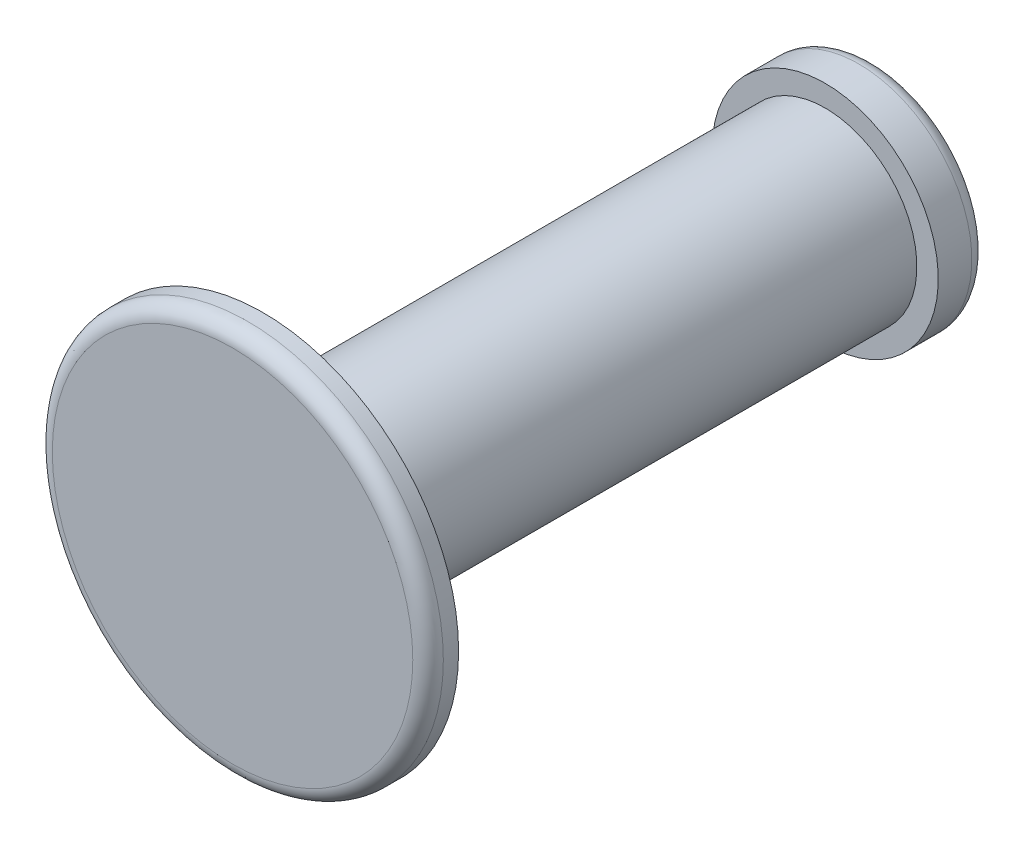
ISO-10303-21;
HEADER;
FILE_DESCRIPTION(('STEP AP214'),'2;1');
FILE_NAME('part.step','',(''),(''),'','','');
FILE_SCHEMA(('AUTOMOTIVE_DESIGN { 1 0 10303 214 1 1 1 1 }'));
ENDSEC;
DATA;
#1=APPLICATION_CONTEXT('core data for automotive mechanical design processes');
#2=APPLICATION_PROTOCOL_DEFINITION('international standard','automotive_design',2000,#1);
#3=PRODUCT_CONTEXT('',#1,'mechanical');
#4=PRODUCT('Part','Part','',(#3));
#5=PRODUCT_RELATED_PRODUCT_CATEGORY('part','',(#4));
#6=PRODUCT_DEFINITION_FORMATION('','',#4);
#7=PRODUCT_DEFINITION_CONTEXT('part definition',#1,'design');
#8=PRODUCT_DEFINITION('design','',#6,#7);
#9=PRODUCT_DEFINITION_SHAPE('','',#8);
#10=(LENGTH_UNIT() NAMED_UNIT(*) SI_UNIT(.MILLI.,.METRE.));
#11=(NAMED_UNIT(*) PLANE_ANGLE_UNIT() SI_UNIT($,.RADIAN.));
#12=(NAMED_UNIT(*) SI_UNIT($,.STERADIAN.) SOLID_ANGLE_UNIT());
#13=UNCERTAINTY_MEASURE_WITH_UNIT(LENGTH_MEASURE(1.E-05),#10,'distance_accuracy_value','');
#14=(GEOMETRIC_REPRESENTATION_CONTEXT(3) GLOBAL_UNCERTAINTY_ASSIGNED_CONTEXT((#13)) GLOBAL_UNIT_ASSIGNED_CONTEXT((#10,
#11,#12)) REPRESENTATION_CONTEXT('',''));
#15=CARTESIAN_POINT('',(0.,0.,0.));
#16=DIRECTION('',(0.,0.,1.));
#17=DIRECTION('',(1.,0.,0.));
#18=AXIS2_PLACEMENT_3D('',#15,#16,#17);
#19=CARTESIAN_POINT('',(0.,0.,2.3));
#20=DIRECTION('',(0.,0.,-1.));
#21=DIRECTION('',(-1.,0.,0.));
#22=AXIS2_PLACEMENT_3D('',#19,#20,#21);
#23=CYLINDRICAL_SURFACE('',#22,0.75);
#24=CARTESIAN_POINT('',(0.,0.,2.3));
#25=DIRECTION('',(0.,0.,1.));
#26=DIRECTION('',(1.,0.,0.));
#27=AXIS2_PLACEMENT_3D('',#24,#25,#26);
#28=CIRCLE('',#27,0.75);
#29=CARTESIAN_POINT('',(0.75,0.,2.3));
#30=VERTEX_POINT('',#29);
#31=EDGE_CURVE('E52',#30,#30,#28,.T.);
#32=ORIENTED_EDGE('',*,*,#31,.F.);
#33=EDGE_LOOP('',(#32));
#34=FACE_BOUND('',#33,.T.);
#35=CARTESIAN_POINT('',(0.,0.,-2.3));
#36=DIRECTION('',(0.,0.,-1.));
#37=DIRECTION('',(-1.,0.,0.));
#38=AXIS2_PLACEMENT_3D('',#35,#36,#37);
#39=CIRCLE('',#38,0.75);
#40=CARTESIAN_POINT('',(-0.75,0.,-2.3));
#41=VERTEX_POINT('',#40);
#42=EDGE_CURVE('E58',#41,#41,#39,.T.);
#43=ORIENTED_EDGE('',*,*,#42,.F.);
#44=EDGE_LOOP('',(#43));
#45=FACE_BOUND('',#44,.T.);
#46=ADVANCED_FACE('F32',(#34,#45),#23,.T.);
#47=CARTESIAN_POINT('',(0.,0.,2.3));
#48=DIRECTION('',(0.,0.,1.));
#49=DIRECTION('',(1.,0.,0.));
#50=AXIS2_PLACEMENT_3D('',#47,#48,#49);
#51=PLANE('',#50);
#52=CARTESIAN_POINT('',(0.,0.,2.3));
#53=DIRECTION('',(0.,0.,1.));
#54=DIRECTION('',(1.,0.,0.));
#55=AXIS2_PLACEMENT_3D('',#52,#53,#54);
#56=CIRCLE('',#55,1.6);
#57=CARTESIAN_POINT('',(1.6,0.,2.3));
#58=VERTEX_POINT('',#57);
#59=EDGE_CURVE('E55',#58,#58,#56,.T.);
#60=ORIENTED_EDGE('',*,*,#59,.F.);
#61=EDGE_LOOP('',(#60));
#62=FACE_BOUND('',#61,.T.);
#63=ORIENTED_EDGE('',*,*,#31,.T.);
#64=EDGE_LOOP('',(#63));
#65=FACE_BOUND('',#64,.T.);
#66=ADVANCED_FACE('F75',(#62,#65),#51,.F.);
#67=CARTESIAN_POINT('',(0.,0.,2.55));
#68=DIRECTION('',(0.,0.,-1.));
#69=DIRECTION('',(-1.,0.,0.));
#70=AXIS2_PLACEMENT_3D('',#67,#68,#69);
#71=CYLINDRICAL_SURFACE('',#70,1.6);
#72=CARTESIAN_POINT('',(0.,0.,2.425));
#73=DIRECTION('',(0.,0.,1.));
#74=DIRECTION('',(1.,0.,0.));
#75=AXIS2_PLACEMENT_3D('',#72,#73,#74);
#76=CIRCLE('',#75,1.6);
#77=CARTESIAN_POINT('',(1.6,0.,2.425));
#78=VERTEX_POINT('',#77);
#79=EDGE_CURVE('E43',#78,#78,#76,.F.);
#80=ORIENTED_EDGE('',*,*,#79,.T.);
#81=EDGE_LOOP('',(#80));
#82=FACE_BOUND('',#81,.T.);
#83=ORIENTED_EDGE('',*,*,#59,.T.);
#84=EDGE_LOOP('',(#83));
#85=FACE_BOUND('',#84,.T.);
#86=ADVANCED_FACE('F81',(#82,#85),#71,.T.);
#87=CARTESIAN_POINT('',(0.,0.,2.55));
#88=DIRECTION('',(0.,0.,1.));
#89=DIRECTION('',(1.,0.,0.));
#90=AXIS2_PLACEMENT_3D('',#87,#88,#89);
#91=PLANE('',#90);
#92=CARTESIAN_POINT('',(0.,0.,2.55));
#93=DIRECTION('',(0.,0.,1.));
#94=DIRECTION('',(1.,0.,0.));
#95=AXIS2_PLACEMENT_3D('',#92,#93,#94);
#96=CIRCLE('',#95,1.475);
#97=CARTESIAN_POINT('',(1.475,0.,2.55));
#98=VERTEX_POINT('',#97);
#99=EDGE_CURVE('E47',#98,#98,#96,.T.);
#100=ORIENTED_EDGE('',*,*,#99,.T.);
#101=EDGE_LOOP('',(#100));
#102=FACE_BOUND('',#101,.T.);
#103=ADVANCED_FACE('F70',(#102),#91,.T.);
#104=CARTESIAN_POINT('',(0.,0.,-2.3));
#105=DIRECTION('',(0.,0.,-1.));
#106=DIRECTION('',(-1.,0.,0.));
#107=AXIS2_PLACEMENT_3D('',#104,#105,#106);
#108=PLANE('',#107);
#109=CARTESIAN_POINT('',(0.,0.,-2.3));
#110=DIRECTION('',(0.,0.,-1.));
#111=DIRECTION('',(-1.,0.,0.));
#112=AXIS2_PLACEMENT_3D('',#109,#110,#111);
#113=CIRCLE('',#112,0.925);
#114=CARTESIAN_POINT('',(-0.925,0.,-2.3));
#115=VERTEX_POINT('',#114);
#116=EDGE_CURVE('E61',#115,#115,#113,.T.);
#117=ORIENTED_EDGE('',*,*,#116,.F.);
#118=EDGE_LOOP('',(#117));
#119=FACE_BOUND('',#118,.T.);
#120=ORIENTED_EDGE('',*,*,#42,.T.);
#121=EDGE_LOOP('',(#120));
#122=FACE_BOUND('',#121,.T.);
#123=ADVANCED_FACE('F67',(#119,#122),#108,.F.);
#124=CARTESIAN_POINT('',(0.,0.,-2.7));
#125=DIRECTION('',(0.,0.,1.));
#126=DIRECTION('',(1.,0.,0.));
#127=AXIS2_PLACEMENT_3D('',#124,#125,#126);
#128=CYLINDRICAL_SURFACE('',#127,0.925);
#129=CARTESIAN_POINT('',(0.,0.,-2.575));
#130=DIRECTION('',(0.,0.,-1.));
#131=DIRECTION('',(-1.,0.,0.));
#132=AXIS2_PLACEMENT_3D('',#129,#130,#131);
#133=CIRCLE('',#132,0.925);
#134=CARTESIAN_POINT('',(-0.925,0.,-2.575));
#135=VERTEX_POINT('',#134);
#136=EDGE_CURVE('E10',#135,#135,#133,.F.);
#137=ORIENTED_EDGE('',*,*,#136,.T.);
#138=EDGE_LOOP('',(#137));
#139=FACE_BOUND('',#138,.T.);
#140=ORIENTED_EDGE('',*,*,#116,.T.);
#141=EDGE_LOOP('',(#140));
#142=FACE_BOUND('',#141,.T.);
#143=ADVANCED_FACE('F65',(#139,#142),#128,.T.);
#144=CARTESIAN_POINT('',(0.,0.,-2.7));
#145=DIRECTION('',(0.,0.,-1.));
#146=DIRECTION('',(-1.,0.,0.));
#147=AXIS2_PLACEMENT_3D('',#144,#145,#146);
#148=PLANE('',#147);
#149=CARTESIAN_POINT('',(0.,0.,-2.7));
#150=DIRECTION('',(0.,0.,-1.));
#151=DIRECTION('',(-1.,0.,0.));
#152=AXIS2_PLACEMENT_3D('',#149,#150,#151);
#153=CIRCLE('',#152,0.8);
#154=CARTESIAN_POINT('',(-0.8,0.,-2.7));
#155=VERTEX_POINT('',#154);
#156=EDGE_CURVE('E39',#155,#155,#153,.T.);
#157=ORIENTED_EDGE('',*,*,#156,.T.);
#158=EDGE_LOOP('',(#157));
#159=FACE_BOUND('',#158,.T.);
#160=ADVANCED_FACE('F88',(#159),#148,.T.);
#161=CARTESIAN_POINT('',(0.,0.,2.425));
#162=DIRECTION('',(0.,0.,1.));
#163=DIRECTION('',(1.,0.,0.));
#164=AXIS2_PLACEMENT_3D('',#161,#162,#163);
#165=TOROIDAL_SURFACE('',#164,1.475,0.125);
#166=ORIENTED_EDGE('',*,*,#79,.F.);
#167=EDGE_LOOP('',(#166));
#168=FACE_BOUND('',#167,.T.);
#169=ORIENTED_EDGE('',*,*,#99,.F.);
#170=EDGE_LOOP('',(#169));
#171=FACE_BOUND('',#170,.T.);
#172=ADVANCED_FACE('F86',(#168,#171),#165,.T.);
#173=CARTESIAN_POINT('',(0.,0.,-2.575));
#174=DIRECTION('',(0.,0.,-1.));
#175=DIRECTION('',(-1.,0.,0.));
#176=AXIS2_PLACEMENT_3D('',#173,#174,#175);
#177=TOROIDAL_SURFACE('',#176,0.8,0.125);
#178=ORIENTED_EDGE('',*,*,#136,.F.);
#179=EDGE_LOOP('',(#178));
#180=FACE_BOUND('',#179,.T.);
#181=ORIENTED_EDGE('',*,*,#156,.F.);
#182=EDGE_LOOP('',(#181));
#183=FACE_BOUND('',#182,.T.);
#184=ADVANCED_FACE('F34',(#180,#183),#177,.T.);
#185=CLOSED_SHELL('',(#46,#66,#86,#103,#123,#143,#160,#172,#184));
#186=MANIFOLD_SOLID_BREP('B2',#185);
#187=ADVANCED_BREP_SHAPE_REPRESENTATION('',(#18,#186),#14);
#188=SHAPE_DEFINITION_REPRESENTATION(#9,#187);
ENDSEC;
END-ISO-10303-21;
